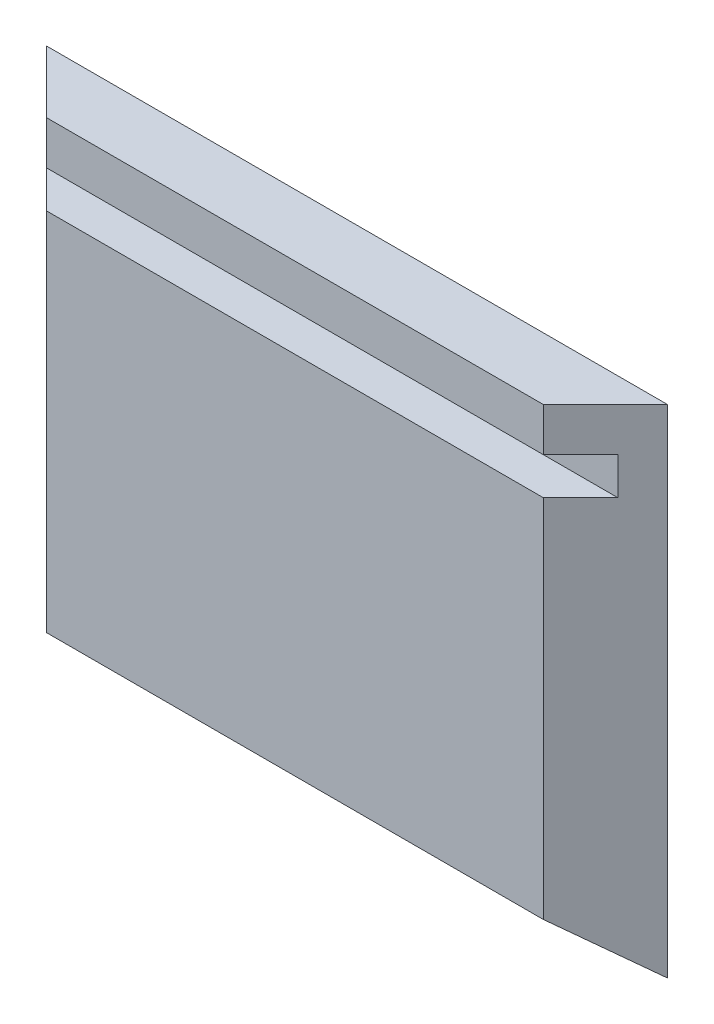
ISO-10303-21;
HEADER;
FILE_DESCRIPTION(('STEP AP214'),'2;1');
FILE_NAME('part.step','',(''),(''),'','','');
FILE_SCHEMA(('AUTOMOTIVE_DESIGN { 1 0 10303 214 1 1 1 1 }'));
ENDSEC;
DATA;
#1=APPLICATION_CONTEXT('core data for automotive mechanical design processes');
#2=APPLICATION_PROTOCOL_DEFINITION('international standard','automotive_design',2000,#1);
#3=PRODUCT_CONTEXT('',#1,'mechanical');
#4=PRODUCT('Part','Part','',(#3));
#5=PRODUCT_RELATED_PRODUCT_CATEGORY('part','',(#4));
#6=PRODUCT_DEFINITION_FORMATION('','',#4);
#7=PRODUCT_DEFINITION_CONTEXT('part definition',#1,'design');
#8=PRODUCT_DEFINITION('design','',#6,#7);
#9=PRODUCT_DEFINITION_SHAPE('','',#8);
#10=(LENGTH_UNIT() NAMED_UNIT(*) SI_UNIT(.MILLI.,.METRE.));
#11=(NAMED_UNIT(*) PLANE_ANGLE_UNIT() SI_UNIT($,.RADIAN.));
#12=(NAMED_UNIT(*) SI_UNIT($,.STERADIAN.) SOLID_ANGLE_UNIT());
#13=UNCERTAINTY_MEASURE_WITH_UNIT(LENGTH_MEASURE(1.E-05),#10,'distance_accuracy_value','');
#14=(GEOMETRIC_REPRESENTATION_CONTEXT(3) GLOBAL_UNCERTAINTY_ASSIGNED_CONTEXT((#13)) GLOBAL_UNIT_ASSIGNED_CONTEXT((#10,
#11,#12)) REPRESENTATION_CONTEXT('',''));
#15=CARTESIAN_POINT('',(0.,0.,0.));
#16=DIRECTION('',(0.,0.,1.));
#17=DIRECTION('',(1.,0.,0.));
#18=AXIS2_PLACEMENT_3D('',#15,#16,#17);
#19=CARTESIAN_POINT('',(0.,0.,5.));
#20=DIRECTION('',(0.,0.,1.));
#21=DIRECTION('',(1.,0.,0.));
#22=AXIS2_PLACEMENT_3D('',#19,#20,#21);
#23=PLANE('',#22);
#24=DIRECTION('',(1.,0.,0.));
#25=VECTOR('',#24,1.);
#26=CARTESIAN_POINT('',(-25.,16.5,5.));
#27=LINE('',#26,#25);
#28=CARTESIAN_POINT('',(-20.,16.5,5.));
#29=VERTEX_POINT('',#28);
#30=CARTESIAN_POINT('',(20.,16.5,5.));
#31=VERTEX_POINT('',#30);
#32=EDGE_CURVE('E105',#29,#31,#27,.T.);
#33=ORIENTED_EDGE('',*,*,#32,.T.);
#34=DIRECTION('',(0.,1.,0.));
#35=VECTOR('',#34,1.);
#36=CARTESIAN_POINT('',(20.,-20.,5.));
#37=LINE('',#36,#35);
#38=CARTESIAN_POINT('',(20.,20.,5.));
#39=VERTEX_POINT('',#38);
#40=EDGE_CURVE('E138',#31,#39,#37,.T.);
#41=ORIENTED_EDGE('',*,*,#40,.T.);
#42=DIRECTION('',(-1.,0.,0.));
#43=VECTOR('',#42,1.);
#44=CARTESIAN_POINT('',(-25.,20.,5.));
#45=LINE('',#44,#43);
#46=CARTESIAN_POINT('',(-20.,20.,5.));
#47=VERTEX_POINT('',#46);
#48=EDGE_CURVE('E140',#39,#47,#45,.T.);
#49=ORIENTED_EDGE('',*,*,#48,.T.);
#50=DIRECTION('',(0.,1.,0.));
#51=VECTOR('',#50,1.);
#52=CARTESIAN_POINT('',(-20.,-20.,5.));
#53=LINE('',#52,#51);
#54=EDGE_CURVE('E130',#29,#47,#53,.T.);
#55=ORIENTED_EDGE('',*,*,#54,.F.);
#56=EDGE_LOOP('',(#33,#41,#49,#55));
#57=FACE_BOUND('',#56,.T.);
#58=ADVANCED_FACE('F33',(#57),#23,.T.);
#59=CARTESIAN_POINT('',(-25.,20.,5.));
#60=DIRECTION('',(0.,-1.,0.));
#61=DIRECTION('',(0.,0.,-1.));
#62=AXIS2_PLACEMENT_3D('',#59,#60,#61);
#63=PLANE('',#62);
#64=DIRECTION('',(-1.,0.,0.));
#65=VECTOR('',#64,1.);
#66=CARTESIAN_POINT('',(-25.,20.,0.));
#67=LINE('',#66,#65);
#68=CARTESIAN_POINT('',(25.,20.,0.));
#69=VERTEX_POINT('',#68);
#70=CARTESIAN_POINT('',(-25.,20.,0.));
#71=VERTEX_POINT('',#70);
#72=EDGE_CURVE('E146',#69,#71,#67,.T.);
#73=ORIENTED_EDGE('',*,*,#72,.T.);
#74=DIRECTION('',(-0.707106781186552,0.,-0.707106781186544));
#75=VECTOR('',#74,1.);
#76=CARTESIAN_POINT('',(-25.,20.,0.));
#77=LINE('',#76,#75);
#78=EDGE_CURVE('E128',#47,#71,#77,.T.);
#79=ORIENTED_EDGE('',*,*,#78,.F.);
#80=ORIENTED_EDGE('',*,*,#48,.F.);
#81=DIRECTION('',(-0.707106781186546,0.,0.707106781186549));
#82=VECTOR('',#81,1.);
#83=CARTESIAN_POINT('',(25.,20.,0.));
#84=LINE('',#83,#82);
#85=EDGE_CURVE('E127',#69,#39,#84,.T.);
#86=ORIENTED_EDGE('',*,*,#85,.F.);
#87=EDGE_LOOP('',(#73,#79,#80,#86));
#88=FACE_BOUND('',#87,.T.);
#89=ADVANCED_FACE('F35',(#88),#63,.F.);
#90=DIRECTION('',(1.,0.,0.));
#91=VECTOR('',#90,1.);
#92=CARTESIAN_POINT('',(-25.,13.5,5.));
#93=LINE('',#92,#91);
#94=CARTESIAN_POINT('',(-20.,13.5,5.));
#95=VERTEX_POINT('',#94);
#96=CARTESIAN_POINT('',(20.,13.5,5.));
#97=VERTEX_POINT('',#96);
#98=EDGE_CURVE('E99',#95,#97,#93,.T.);
#99=ORIENTED_EDGE('',*,*,#98,.F.);
#100=CARTESIAN_POINT('',(-19.9999999999999,-15.9168201351779,5.));
#101=VERTEX_POINT('',#100);
#102=EDGE_CURVE('E132',#101,#95,#53,.T.);
#103=ORIENTED_EDGE('',*,*,#102,.F.);
#104=DIRECTION('',(1.,0.,0.));
#105=VECTOR('',#104,1.);
#106=CARTESIAN_POINT('',(-25.,-15.9168201351779,5.));
#107=LINE('',#106,#105);
#108=CARTESIAN_POINT('',(20.,-15.9168201351779,5.));
#109=VERTEX_POINT('',#108);
#110=EDGE_CURVE('E56',#101,#109,#107,.T.);
#111=ORIENTED_EDGE('',*,*,#110,.T.);
#112=EDGE_CURVE('E131',#109,#97,#37,.T.);
#113=ORIENTED_EDGE('',*,*,#112,.T.);
#114=EDGE_LOOP('',(#99,#103,#111,#113));
#115=FACE_BOUND('',#114,.T.);
#116=ADVANCED_FACE('F160',(#115),#23,.T.);
#117=CARTESIAN_POINT('',(0.,0.,0.));
#118=DIRECTION('',(0.,0.,1.));
#119=DIRECTION('',(1.,0.,0.));
#120=AXIS2_PLACEMENT_3D('',#117,#118,#119);
#121=PLANE('',#120);
#122=DIRECTION('',(0.,1.,0.));
#123=VECTOR('',#122,1.);
#124=CARTESIAN_POINT('',(25.,20.,0.));
#125=LINE('',#124,#123);
#126=CARTESIAN_POINT('',(25.,-20.,0.));
#127=VERTEX_POINT('',#126);
#128=EDGE_CURVE('E135',#127,#69,#125,.T.);
#129=ORIENTED_EDGE('',*,*,#128,.F.);
#130=DIRECTION('',(1.,0.,0.));
#131=VECTOR('',#130,1.);
#132=CARTESIAN_POINT('',(-25.,-20.,0.));
#133=LINE('',#132,#131);
#134=CARTESIAN_POINT('',(-25.,-20.,0.));
#135=VERTEX_POINT('',#134);
#136=EDGE_CURVE('E144',#135,#127,#133,.T.);
#137=ORIENTED_EDGE('',*,*,#136,.F.);
#138=DIRECTION('',(0.,-1.,0.));
#139=VECTOR('',#138,1.);
#140=CARTESIAN_POINT('',(-25.,20.,0.));
#141=LINE('',#140,#139);
#142=EDGE_CURVE('E149',#71,#135,#141,.T.);
#143=ORIENTED_EDGE('',*,*,#142,.F.);
#144=ORIENTED_EDGE('',*,*,#72,.F.);
#145=EDGE_LOOP('',(#129,#137,#143,#144));
#146=FACE_BOUND('',#145,.T.);
#147=ADVANCED_FACE('F175',(#146),#121,.F.);
#148=CARTESIAN_POINT('',(25.,-20.,0.));
#149=DIRECTION('',(-0.707106781186549,0.,-0.707106781186546));
#150=DIRECTION('',(-0.707106781186546,0.,0.707106781186549));
#151=AXIS2_PLACEMENT_3D('',#148,#149,#150);
#152=PLANE('',#151);
#153=ORIENTED_EDGE('',*,*,#40,.F.);
#154=DIRECTION('',(0.707106781186546,0.,-0.707106781186549));
#155=VECTOR('',#154,1.);
#156=CARTESIAN_POINT('',(25.,16.5,0.));
#157=LINE('',#156,#155);
#158=CARTESIAN_POINT('',(23.,16.5,2.));
#159=VERTEX_POINT('',#158);
#160=EDGE_CURVE('E118',#31,#159,#157,.T.);
#161=ORIENTED_EDGE('',*,*,#160,.T.);
#162=DIRECTION('',(0.,-1.,0.));
#163=VECTOR('',#162,1.);
#164=CARTESIAN_POINT('',(23.,-20.,1.99999999999999));
#165=LINE('',#164,#163);
#166=CARTESIAN_POINT('',(23.,13.5,2.));
#167=VERTEX_POINT('',#166);
#168=EDGE_CURVE('E104',#159,#167,#165,.T.);
#169=ORIENTED_EDGE('',*,*,#168,.T.);
#170=DIRECTION('',(-0.707106781186546,0.,0.707106781186549));
#171=VECTOR('',#170,1.);
#172=CARTESIAN_POINT('',(25.,13.5,0.));
#173=LINE('',#172,#171);
#174=EDGE_CURVE('E96',#167,#97,#173,.T.);
#175=ORIENTED_EDGE('',*,*,#174,.T.);
#176=ORIENTED_EDGE('',*,*,#112,.F.);
#177=DIRECTION('',(0.612346299131338,-0.500064015782286,-0.61234629913134));
#178=VECTOR('',#177,1.);
#179=CARTESIAN_POINT('',(25.,-20.,0.));
#180=LINE('',#179,#178);
#181=EDGE_CURVE('E124',#109,#127,#180,.T.);
#182=ORIENTED_EDGE('',*,*,#181,.T.);
#183=ORIENTED_EDGE('',*,*,#128,.T.);
#184=ORIENTED_EDGE('',*,*,#85,.T.);
#185=EDGE_LOOP('',(#153,#161,#169,#175,#176,#182,#183,#184));
#186=FACE_BOUND('',#185,.T.);
#187=ADVANCED_FACE('F117',(#186),#152,.F.);
#188=CARTESIAN_POINT('',(-25.,-20.,0.));
#189=DIRECTION('',(0.707106781186543,0.,-0.707106781186552));
#190=DIRECTION('',(-0.707106781186552,0.,-0.707106781186543));
#191=AXIS2_PLACEMENT_3D('',#188,#189,#190);
#192=PLANE('',#191);
#193=DIRECTION('',(0.,1.,0.));
#194=VECTOR('',#193,1.);
#195=CARTESIAN_POINT('',(-23.,-20.,1.99999999999999));
#196=LINE('',#195,#194);
#197=CARTESIAN_POINT('',(-23.,13.5,2.));
#198=VERTEX_POINT('',#197);
#199=CARTESIAN_POINT('',(-23.,16.5,2.));
#200=VERTEX_POINT('',#199);
#201=EDGE_CURVE('E41',#198,#200,#196,.T.);
#202=ORIENTED_EDGE('',*,*,#201,.T.);
#203=DIRECTION('',(0.707106781186552,0.,0.707106781186543));
#204=VECTOR('',#203,1.);
#205=CARTESIAN_POINT('',(-25.,16.5,0.));
#206=LINE('',#205,#204);
#207=EDGE_CURVE('E11',#200,#29,#206,.T.);
#208=ORIENTED_EDGE('',*,*,#207,.T.);
#209=ORIENTED_EDGE('',*,*,#54,.T.);
#210=ORIENTED_EDGE('',*,*,#78,.T.);
#211=ORIENTED_EDGE('',*,*,#142,.T.);
#212=DIRECTION('',(0.612346299131343,0.500064015782283,0.612346299131336));
#213=VECTOR('',#212,1.);
#214=CARTESIAN_POINT('',(-25.,-20.,0.));
#215=LINE('',#214,#213);
#216=EDGE_CURVE('E143',#135,#101,#215,.T.);
#217=ORIENTED_EDGE('',*,*,#216,.T.);
#218=ORIENTED_EDGE('',*,*,#102,.T.);
#219=DIRECTION('',(-0.707106781186552,0.,-0.707106781186543));
#220=VECTOR('',#219,1.);
#221=CARTESIAN_POINT('',(-25.,13.5,0.));
#222=LINE('',#221,#220);
#223=EDGE_CURVE('E154',#95,#198,#222,.T.);
#224=ORIENTED_EDGE('',*,*,#223,.T.);
#225=EDGE_LOOP('',(#202,#208,#209,#210,#211,#217,#218,#224));
#226=FACE_BOUND('',#225,.T.);
#227=ADVANCED_FACE('F156',(#226),#192,.F.);
#228=CARTESIAN_POINT('',(-25.,-20.,0.));
#229=DIRECTION('',(0.,0.774543774585984,-0.632520308962563));
#230=DIRECTION('',(0.,0.632520308962563,0.774543774585984));
#231=AXIS2_PLACEMENT_3D('',#228,#229,#230);
#232=PLANE('',#231);
#233=ORIENTED_EDGE('',*,*,#110,.F.);
#234=ORIENTED_EDGE('',*,*,#216,.F.);
#235=ORIENTED_EDGE('',*,*,#136,.T.);
#236=ORIENTED_EDGE('',*,*,#181,.F.);
#237=EDGE_LOOP('',(#233,#234,#235,#236));
#238=FACE_BOUND('',#237,.T.);
#239=ADVANCED_FACE('F176',(#238),#232,.F.);
#240=CARTESIAN_POINT('',(-25.,16.5,5.));
#241=DIRECTION('',(0.,1.,0.));
#242=DIRECTION('',(0.,0.,1.));
#243=AXIS2_PLACEMENT_3D('',#240,#241,#242);
#244=PLANE('',#243);
#245=ORIENTED_EDGE('',*,*,#32,.F.);
#246=ORIENTED_EDGE('',*,*,#207,.F.);
#247=DIRECTION('',(1.,0.,0.));
#248=VECTOR('',#247,1.);
#249=CARTESIAN_POINT('',(-25.,16.5,2.));
#250=LINE('',#249,#248);
#251=EDGE_CURVE('E113',#200,#159,#250,.T.);
#252=ORIENTED_EDGE('',*,*,#251,.T.);
#253=ORIENTED_EDGE('',*,*,#160,.F.);
#254=EDGE_LOOP('',(#245,#246,#252,#253));
#255=FACE_BOUND('',#254,.T.);
#256=ADVANCED_FACE('F178',(#255),#244,.F.);
#257=CARTESIAN_POINT('',(-25.,16.5,2.));
#258=DIRECTION('',(0.,0.,-1.));
#259=DIRECTION('',(0.,1.,0.));
#260=AXIS2_PLACEMENT_3D('',#257,#258,#259);
#261=PLANE('',#260);
#262=ORIENTED_EDGE('',*,*,#251,.F.);
#263=ORIENTED_EDGE('',*,*,#201,.F.);
#264=DIRECTION('',(1.,0.,0.));
#265=VECTOR('',#264,1.);
#266=CARTESIAN_POINT('',(-25.,13.5,2.));
#267=LINE('',#266,#265);
#268=EDGE_CURVE('E48',#198,#167,#267,.T.);
#269=ORIENTED_EDGE('',*,*,#268,.T.);
#270=ORIENTED_EDGE('',*,*,#168,.F.);
#271=EDGE_LOOP('',(#262,#263,#269,#270));
#272=FACE_BOUND('',#271,.T.);
#273=ADVANCED_FACE('F109',(#272),#261,.F.);
#274=CARTESIAN_POINT('',(-25.,13.5,5.));
#275=DIRECTION('',(0.,-1.,0.));
#276=DIRECTION('',(0.,0.,-1.));
#277=AXIS2_PLACEMENT_3D('',#274,#275,#276);
#278=PLANE('',#277);
#279=ORIENTED_EDGE('',*,*,#268,.F.);
#280=ORIENTED_EDGE('',*,*,#223,.F.);
#281=ORIENTED_EDGE('',*,*,#98,.T.);
#282=ORIENTED_EDGE('',*,*,#174,.F.);
#283=EDGE_LOOP('',(#279,#280,#281,#282));
#284=FACE_BOUND('',#283,.T.);
#285=ADVANCED_FACE('F97',(#284),#278,.F.);
#286=CLOSED_SHELL('',(#58,#89,#116,#147,#187,#227,#239,#256,#273,#285));
#287=MANIFOLD_SOLID_BREP('B2',#286);
#288=ADVANCED_BREP_SHAPE_REPRESENTATION('',(#18,#287),#14);
#289=SHAPE_DEFINITION_REPRESENTATION(#9,#288);
ENDSEC;
END-ISO-10303-21;
